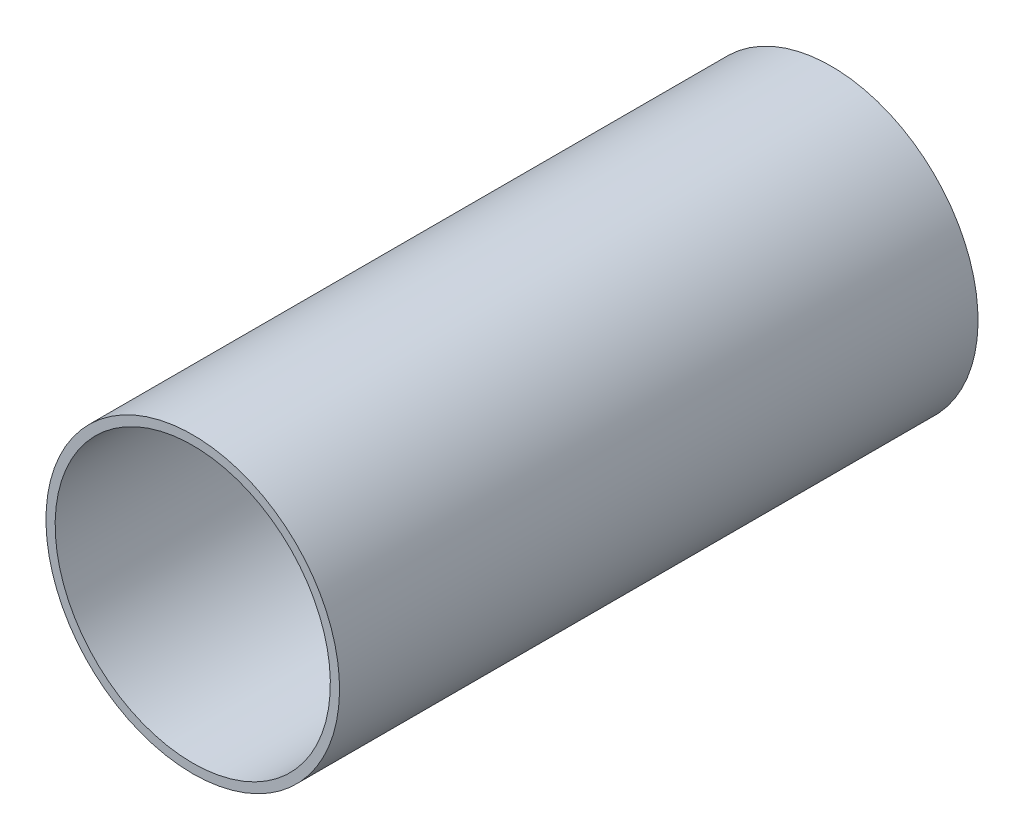
ISO-10303-21;
HEADER;
FILE_DESCRIPTION(('STEP AP214'),'2;1');
FILE_NAME('part.step','',(''),(''),'','','');
FILE_SCHEMA(('AUTOMOTIVE_DESIGN { 1 0 10303 214 1 1 1 1 }'));
ENDSEC;
DATA;
#1=APPLICATION_CONTEXT('core data for automotive mechanical design processes');
#2=APPLICATION_PROTOCOL_DEFINITION('international standard','automotive_design',2000,#1);
#3=PRODUCT_CONTEXT('',#1,'mechanical');
#4=PRODUCT('Part','Part','',(#3));
#5=PRODUCT_RELATED_PRODUCT_CATEGORY('part','',(#4));
#6=PRODUCT_DEFINITION_FORMATION('','',#4);
#7=PRODUCT_DEFINITION_CONTEXT('part definition',#1,'design');
#8=PRODUCT_DEFINITION('design','',#6,#7);
#9=PRODUCT_DEFINITION_SHAPE('','',#8);
#10=(LENGTH_UNIT() NAMED_UNIT(*) SI_UNIT(.MILLI.,.METRE.));
#11=(NAMED_UNIT(*) PLANE_ANGLE_UNIT() SI_UNIT($,.RADIAN.));
#12=(NAMED_UNIT(*) SI_UNIT($,.STERADIAN.) SOLID_ANGLE_UNIT());
#13=UNCERTAINTY_MEASURE_WITH_UNIT(LENGTH_MEASURE(1.E-05),#10,'distance_accuracy_value','');
#14=(GEOMETRIC_REPRESENTATION_CONTEXT(3) GLOBAL_UNCERTAINTY_ASSIGNED_CONTEXT((#13)) GLOBAL_UNIT_ASSIGNED_CONTEXT((#10,
#11,#12)) REPRESENTATION_CONTEXT('',''));
#15=CARTESIAN_POINT('',(0.,0.,0.));
#16=DIRECTION('',(0.,0.,1.));
#17=DIRECTION('',(1.,0.,0.));
#18=AXIS2_PLACEMENT_3D('',#15,#16,#17);
#19=CARTESIAN_POINT('',(165.608,-72.644,-0.045));
#20=DIRECTION('',(0.,0.,-1.));
#21=DIRECTION('',(0.,-1.,0.));
#22=AXIS2_PLACEMENT_3D('',#19,#20,#21);
#23=CYLINDRICAL_SURFACE('',#22,0.375);
#24=CARTESIAN_POINT('',(165.608,-72.644,-0.035));
#25=DIRECTION('',(0.,0.,-1.));
#26=DIRECTION('',(0.,-1.,0.));
#27=AXIS2_PLACEMENT_3D('',#24,#25,#26);
#28=CIRCLE('',#27,0.375);
#29=CARTESIAN_POINT('',(165.608,-73.019,-0.035));
#30=VERTEX_POINT('',#29);
#31=EDGE_CURVE('E63',#30,#30,#28,.T.);
#32=ORIENTED_EDGE('',*,*,#31,.T.);
#33=DIRECTION('',(0.,0.,1.));
#34=VECTOR('',#33,1.);
#35=CARTESIAN_POINT('',(165.608,-73.019,-0.045));
#36=LINE('',#35,#34);
#37=CARTESIAN_POINT('',(165.608,-73.019,1.705));
#38=VERTEX_POINT('',#37);
#39=EDGE_CURVE('E11',#30,#38,#36,.T.);
#40=ORIENTED_EDGE('',*,*,#39,.T.);
#41=CARTESIAN_POINT('',(165.608,-72.644,1.705));
#42=DIRECTION('',(0.,0.,-1.));
#43=DIRECTION('',(0.,-1.,0.));
#44=AXIS2_PLACEMENT_3D('',#41,#42,#43);
#45=CIRCLE('',#44,0.375);
#46=EDGE_CURVE('E25',#38,#38,#45,.T.);
#47=ORIENTED_EDGE('',*,*,#46,.F.);
#48=ORIENTED_EDGE('',*,*,#39,.F.);
#49=EDGE_LOOP('',(#32,#40,#47,#48));
#50=FACE_BOUND('',#49,.T.);
#51=ADVANCED_FACE('F17',(#50),#23,.F.);
#52=CARTESIAN_POINT('',(165.608,-73.044,1.705));
#53=DIRECTION('',(0.,0.,1.));
#54=DIRECTION('',(1.,0.,0.));
#55=AXIS2_PLACEMENT_3D('',#52,#53,#54);
#56=PLANE('',#55);
#57=ORIENTED_EDGE('',*,*,#46,.T.);
#58=EDGE_LOOP('',(#57));
#59=FACE_BOUND('',#58,.T.);
#60=CARTESIAN_POINT('',(165.608,-72.644,1.705));
#61=DIRECTION('',(0.,0.,1.));
#62=DIRECTION('',(0.,-1.,0.));
#63=AXIS2_PLACEMENT_3D('',#60,#61,#62);
#64=CIRCLE('',#63,0.4);
#65=CARTESIAN_POINT('',(165.608,-73.044,1.705));
#66=VERTEX_POINT('',#65);
#67=EDGE_CURVE('E55',#66,#66,#64,.T.);
#68=ORIENTED_EDGE('',*,*,#67,.T.);
#69=EDGE_LOOP('',(#68));
#70=FACE_BOUND('',#69,.T.);
#71=ADVANCED_FACE('F72',(#59,#70),#56,.T.);
#72=CARTESIAN_POINT('',(165.608,-73.044,-0.035));
#73=DIRECTION('',(0.,0.,1.));
#74=DIRECTION('',(1.,0.,0.));
#75=AXIS2_PLACEMENT_3D('',#72,#73,#74);
#76=PLANE('',#75);
#77=ORIENTED_EDGE('',*,*,#31,.F.);
#78=EDGE_LOOP('',(#77));
#79=FACE_BOUND('',#78,.T.);
#80=CARTESIAN_POINT('',(165.608,-72.644,-0.035));
#81=DIRECTION('',(0.,0.,1.));
#82=DIRECTION('',(0.,-1.,0.));
#83=AXIS2_PLACEMENT_3D('',#80,#81,#82);
#84=CIRCLE('',#83,0.4);
#85=CARTESIAN_POINT('',(165.608,-73.044,-0.035));
#86=VERTEX_POINT('',#85);
#87=EDGE_CURVE('E54',#86,#86,#84,.T.);
#88=ORIENTED_EDGE('',*,*,#87,.F.);
#89=EDGE_LOOP('',(#88));
#90=FACE_BOUND('',#89,.T.);
#91=ADVANCED_FACE('F81',(#79,#90),#76,.F.);
#92=CARTESIAN_POINT('',(165.608,-72.644,-0.035));
#93=DIRECTION('',(0.,0.,-1.));
#94=DIRECTION('',(0.,-1.,0.));
#95=AXIS2_PLACEMENT_3D('',#92,#93,#94);
#96=CYLINDRICAL_SURFACE('',#95,0.4);
#97=ORIENTED_EDGE('',*,*,#87,.T.);
#98=DIRECTION('',(0.,0.,1.));
#99=VECTOR('',#98,1.);
#100=CARTESIAN_POINT('',(165.608,-73.044,-0.035));
#101=LINE('',#100,#99);
#102=EDGE_CURVE('E51',#86,#66,#101,.T.);
#103=ORIENTED_EDGE('',*,*,#102,.T.);
#104=ORIENTED_EDGE('',*,*,#67,.F.);
#105=ORIENTED_EDGE('',*,*,#102,.F.);
#106=EDGE_LOOP('',(#97,#103,#104,#105));
#107=FACE_BOUND('',#106,.T.);
#108=ADVANCED_FACE('F52',(#107),#96,.T.);
#109=CLOSED_SHELL('',(#51,#71,#91,#108));
#110=MANIFOLD_SOLID_BREP('B1',#109);
#111=ADVANCED_BREP_SHAPE_REPRESENTATION('',(#18,#110),#14);
#112=SHAPE_DEFINITION_REPRESENTATION(#9,#111);
ENDSEC;
END-ISO-10303-21;
